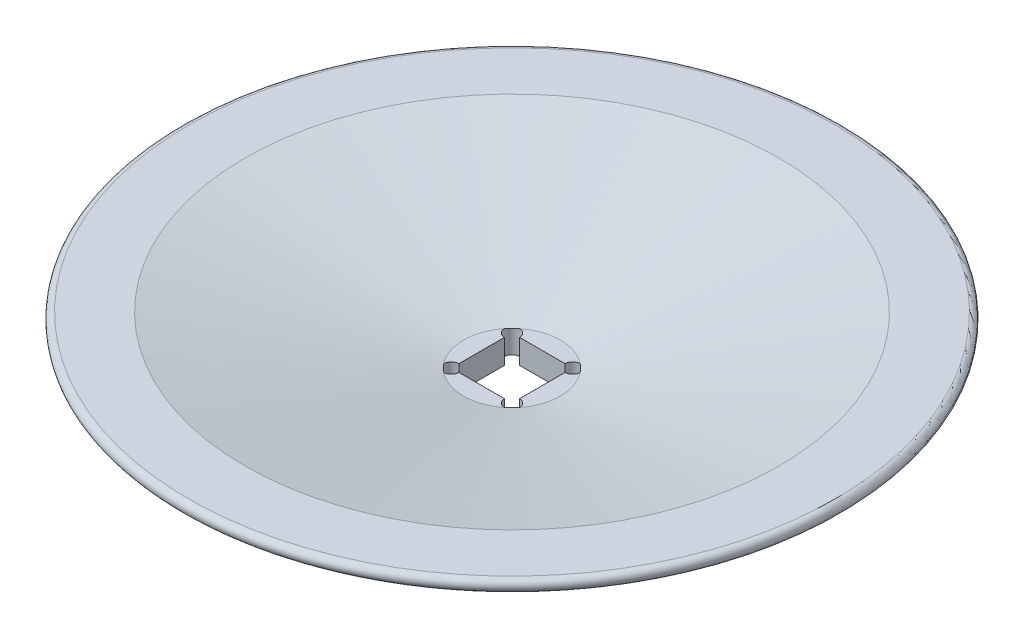
ISO-10303-21;
HEADER;
FILE_DESCRIPTION(('STEP AP214'),'2;1');
FILE_NAME('part.step','',(''),(''),'','','');
FILE_SCHEMA(('AUTOMOTIVE_DESIGN { 1 0 10303 214 1 1 1 1 }'));
ENDSEC;
DATA;
#1=APPLICATION_CONTEXT('core data for automotive mechanical design processes');
#2=APPLICATION_PROTOCOL_DEFINITION('international standard','automotive_design',2000,#1);
#3=PRODUCT_CONTEXT('',#1,'mechanical');
#4=PRODUCT('Part','Part','',(#3));
#5=PRODUCT_RELATED_PRODUCT_CATEGORY('part','',(#4));
#6=PRODUCT_DEFINITION_FORMATION('','',#4);
#7=PRODUCT_DEFINITION_CONTEXT('part definition',#1,'design');
#8=PRODUCT_DEFINITION('design','',#6,#7);
#9=PRODUCT_DEFINITION_SHAPE('','',#8);
#10=(LENGTH_UNIT() NAMED_UNIT(*) SI_UNIT(.MILLI.,.METRE.));
#11=(NAMED_UNIT(*) PLANE_ANGLE_UNIT() SI_UNIT($,.RADIAN.));
#12=(NAMED_UNIT(*) SI_UNIT($,.STERADIAN.) SOLID_ANGLE_UNIT());
#13=UNCERTAINTY_MEASURE_WITH_UNIT(LENGTH_MEASURE(1.E-05),#10,'distance_accuracy_value','');
#14=(GEOMETRIC_REPRESENTATION_CONTEXT(3) GLOBAL_UNCERTAINTY_ASSIGNED_CONTEXT((#13)) GLOBAL_UNIT_ASSIGNED_CONTEXT((#10,
#11,#12)) REPRESENTATION_CONTEXT('',''));
#15=CARTESIAN_POINT('',(0.,0.,0.));
#16=DIRECTION('',(0.,0.,1.));
#17=DIRECTION('',(1.,0.,0.));
#18=AXIS2_PLACEMENT_3D('',#15,#16,#17);
#19=CARTESIAN_POINT('',(0.,0.,0.));
#20=DIRECTION('',(0.,-1.,0.));
#21=DIRECTION('',(0.,0.,-1.));
#22=AXIS2_PLACEMENT_3D('',#19,#20,#21);
#23=PLANE('',#22);
#24=DIRECTION('',(0.,0.,1.));
#25=VECTOR('',#24,1.);
#26=CARTESIAN_POINT('',(2.5,0.,2.5));
#27=LINE('',#26,#25);
#28=CARTESIAN_POINT('',(2.5,0.,-1.875));
#29=VERTEX_POINT('',#28);
#30=CARTESIAN_POINT('',(2.5,0.,1.875));
#31=VERTEX_POINT('',#30);
#32=EDGE_CURVE('E486',#29,#31,#27,.T.);
#33=ORIENTED_EDGE('',*,*,#32,.T.);
#34=CARTESIAN_POINT('',(2.5,0.,2.5));
#35=DIRECTION('',(0.,1.,0.));
#36=DIRECTION('',(0.,0.,1.));
#37=AXIS2_PLACEMENT_3D('',#34,#35,#36);
#38=CIRCLE('',#37,0.625);
#39=CARTESIAN_POINT('',(3.12499222627195,0.,2.49688277372805));
#40=VERTEX_POINT('',#39);
#41=EDGE_CURVE('E575',#40,#31,#38,.T.);
#42=ORIENTED_EDGE('',*,*,#41,.F.);
#43=CARTESIAN_POINT('',(0.,0.,0.));
#44=DIRECTION('',(0.,1.,0.));
#45=DIRECTION('',(0.,0.,1.));
#46=AXIS2_PLACEMENT_3D('',#43,#44,#45);
#47=CIRCLE('',#46,4.);
#48=CARTESIAN_POINT('',(3.12499222627195,0.,-2.49688277372805));
#49=VERTEX_POINT('',#48);
#50=EDGE_CURVE('E441',#40,#49,#47,.T.);
#51=ORIENTED_EDGE('',*,*,#50,.T.);
#52=CARTESIAN_POINT('',(2.5,0.,-2.5));
#53=DIRECTION('',(0.,1.,0.));
#54=DIRECTION('',(0.,0.,1.));
#55=AXIS2_PLACEMENT_3D('',#52,#53,#54);
#56=CIRCLE('',#55,0.625);
#57=EDGE_CURVE('E560',#29,#49,#56,.T.);
#58=ORIENTED_EDGE('',*,*,#57,.F.);
#59=EDGE_LOOP('',(#33,#42,#51,#58));
#60=FACE_BOUND('',#59,.T.);
#61=ADVANCED_FACE('F300',(#60),#23,.F.);
#62=CARTESIAN_POINT('',(-2.49688277372806,0.,3.12499222627195));
#63=VERTEX_POINT('',#62);
#64=CARTESIAN_POINT('',(2.49688277372806,0.,3.12499222627195));
#65=VERTEX_POINT('',#64);
#66=EDGE_CURVE('E418',#63,#65,#47,.T.);
#67=ORIENTED_EDGE('',*,*,#66,.T.);
#68=CARTESIAN_POINT('',(1.875,0.,2.5));
#69=VERTEX_POINT('',#68);
#70=EDGE_CURVE('E578',#69,#65,#38,.T.);
#71=ORIENTED_EDGE('',*,*,#70,.F.);
#72=DIRECTION('',(-1.,0.,0.));
#73=VECTOR('',#72,1.);
#74=CARTESIAN_POINT('',(-2.5,0.,2.5));
#75=LINE('',#74,#73);
#76=CARTESIAN_POINT('',(-1.875,0.,2.5));
#77=VERTEX_POINT('',#76);
#78=EDGE_CURVE('E421',#69,#77,#75,.T.);
#79=ORIENTED_EDGE('',*,*,#78,.T.);
#80=CARTESIAN_POINT('',(-2.5,0.,2.5));
#81=DIRECTION('',(0.,1.,0.));
#82=DIRECTION('',(0.,0.,1.));
#83=AXIS2_PLACEMENT_3D('',#80,#81,#82);
#84=CIRCLE('',#83,0.625);
#85=EDGE_CURVE('E406',#63,#77,#84,.T.);
#86=ORIENTED_EDGE('',*,*,#85,.F.);
#87=EDGE_LOOP('',(#67,#71,#79,#86));
#88=FACE_BOUND('',#87,.T.);
#89=ADVANCED_FACE('F416',(#88),#23,.F.);
#90=CARTESIAN_POINT('',(2.49688277372806,0.,-3.12499222627195));
#91=VERTEX_POINT('',#90);
#92=CARTESIAN_POINT('',(-2.49688277372806,0.,-3.12499222627195));
#93=VERTEX_POINT('',#92);
#94=EDGE_CURVE('E434',#91,#93,#47,.T.);
#95=ORIENTED_EDGE('',*,*,#94,.T.);
#96=CARTESIAN_POINT('',(-2.5,0.,-2.5));
#97=DIRECTION('',(0.,1.,0.));
#98=DIRECTION('',(0.,0.,1.));
#99=AXIS2_PLACEMENT_3D('',#96,#97,#98);
#100=CIRCLE('',#99,0.625);
#101=CARTESIAN_POINT('',(-1.875,0.,-2.5));
#102=VERTEX_POINT('',#101);
#103=EDGE_CURVE('E460',#102,#93,#100,.T.);
#104=ORIENTED_EDGE('',*,*,#103,.F.);
#105=DIRECTION('',(1.,0.,0.));
#106=VECTOR('',#105,1.);
#107=CARTESIAN_POINT('',(-2.5,0.,-2.5));
#108=LINE('',#107,#106);
#109=CARTESIAN_POINT('',(1.875,0.,-2.5));
#110=VERTEX_POINT('',#109);
#111=EDGE_CURVE('E497',#102,#110,#108,.T.);
#112=ORIENTED_EDGE('',*,*,#111,.T.);
#113=EDGE_CURVE('E316',#91,#110,#56,.T.);
#114=ORIENTED_EDGE('',*,*,#113,.F.);
#115=EDGE_LOOP('',(#95,#104,#112,#114));
#116=FACE_BOUND('',#115,.T.);
#117=ADVANCED_FACE('F457',(#116),#23,.F.);
#118=CARTESIAN_POINT('',(-3.12499222627195,0.,-2.49688277372806));
#119=VERTEX_POINT('',#118);
#120=CARTESIAN_POINT('',(-3.12499222627195,0.,2.49688277372806));
#121=VERTEX_POINT('',#120);
#122=EDGE_CURVE('E429',#119,#121,#47,.T.);
#123=ORIENTED_EDGE('',*,*,#122,.T.);
#124=CARTESIAN_POINT('',(-2.5,0.,1.875));
#125=VERTEX_POINT('',#124);
#126=EDGE_CURVE('E409',#125,#121,#84,.T.);
#127=ORIENTED_EDGE('',*,*,#126,.F.);
#128=DIRECTION('',(0.,0.,-1.));
#129=VECTOR('',#128,1.);
#130=CARTESIAN_POINT('',(-2.5,0.,2.5));
#131=LINE('',#130,#129);
#132=CARTESIAN_POINT('',(-2.5,0.,-1.875));
#133=VERTEX_POINT('',#132);
#134=EDGE_CURVE('E493',#125,#133,#131,.T.);
#135=ORIENTED_EDGE('',*,*,#134,.T.);
#136=EDGE_CURVE('E323',#119,#133,#100,.T.);
#137=ORIENTED_EDGE('',*,*,#136,.F.);
#138=EDGE_LOOP('',(#123,#127,#135,#137));
#139=FACE_BOUND('',#138,.T.);
#140=ADVANCED_FACE('F537',(#139),#23,.F.);
#141=CARTESIAN_POINT('',(0.,4.,0.));
#142=DIRECTION('',(0.,1.,0.));
#143=DIRECTION('',(0.,0.,1.));
#144=AXIS2_PLACEMENT_3D('',#141,#142,#143);
#145=CONICAL_SURFACE('',#144,22.,1.35212738092095);
#146=EDGE_CURVE('E427',#65,#40,#47,.T.);
#147=ORIENTED_EDGE('',*,*,#146,.F.);
#148=ORIENTED_EDGE('',*,*,#66,.F.);
#149=CARTESIAN_POINT('',(0.,0.,0.));
#150=DIRECTION('',(0.,1.,0.));
#151=DIRECTION('',(0.,0.,1.));
#152=AXIS2_PLACEMENT_3D('',#149,#150,#151);
#153=CIRCLE('',#152,4.);
#154=EDGE_CURVE('E390',#63,#121,#153,.F.);
#155=ORIENTED_EDGE('',*,*,#154,.T.);
#156=ORIENTED_EDGE('',*,*,#122,.F.);
#157=CARTESIAN_POINT('',(0.,0.,0.));
#158=DIRECTION('',(0.,1.,0.));
#159=DIRECTION('',(0.,0.,1.));
#160=AXIS2_PLACEMENT_3D('',#157,#158,#159);
#161=CIRCLE('',#160,4.);
#162=EDGE_CURVE('E465',#119,#93,#161,.F.);
#163=ORIENTED_EDGE('',*,*,#162,.T.);
#164=ORIENTED_EDGE('',*,*,#94,.F.);
#165=CARTESIAN_POINT('',(0.,0.,0.));
#166=DIRECTION('',(0.,1.,0.));
#167=DIRECTION('',(0.,0.,1.));
#168=AXIS2_PLACEMENT_3D('',#165,#166,#167);
#169=CIRCLE('',#168,4.);
#170=EDGE_CURVE('E464',#91,#49,#169,.F.);
#171=ORIENTED_EDGE('',*,*,#170,.T.);
#172=ORIENTED_EDGE('',*,*,#50,.F.);
#173=EDGE_LOOP('',(#147,#148,#155,#156,#163,#164,#171,#172));
#174=FACE_BOUND('',#173,.T.);
#175=CARTESIAN_POINT('',(0.,4.,0.));
#176=DIRECTION('',(0.,1.,0.));
#177=DIRECTION('',(0.,0.,1.));
#178=AXIS2_PLACEMENT_3D('',#175,#176,#177);
#179=CIRCLE('',#178,22.);
#180=CARTESIAN_POINT('',(0.,4.,22.));
#181=VERTEX_POINT('',#180);
#182=EDGE_CURVE('E430',#181,#181,#179,.T.);
#183=ORIENTED_EDGE('',*,*,#182,.T.);
#184=EDGE_LOOP('',(#183));
#185=FACE_BOUND('',#184,.T.);
#186=ADVANCED_FACE('F424',(#174,#185),#145,.F.);
#187=CARTESIAN_POINT('',(31.2195444572929,4.,0.));
#188=DIRECTION('',(0.,-1.,0.));
#189=DIRECTION('',(0.,0.,-1.));
#190=AXIS2_PLACEMENT_3D('',#187,#188,#189);
#191=PLANE('',#190);
#192=CARTESIAN_POINT('',(0.,4.,0.));
#193=DIRECTION('',(0.,-1.,0.));
#194=DIRECTION('',(0.,0.,-1.));
#195=AXIS2_PLACEMENT_3D('',#192,#193,#194);
#196=CIRCLE('',#195,26.6646583429697);
#197=CARTESIAN_POINT('',(0.,4.,-26.6646583429697));
#198=VERTEX_POINT('',#197);
#199=EDGE_CURVE('E440',#198,#198,#196,.F.);
#200=ORIENTED_EDGE('',*,*,#199,.T.);
#201=EDGE_LOOP('',(#200));
#202=FACE_BOUND('',#201,.T.);
#203=ORIENTED_EDGE('',*,*,#182,.F.);
#204=EDGE_LOOP('',(#203));
#205=FACE_BOUND('',#204,.T.);
#206=ADVANCED_FACE('F547',(#202,#205),#191,.F.);
#207=CARTESIAN_POINT('',(0.,-2.,0.));
#208=DIRECTION('',(0.,1.,0.));
#209=DIRECTION('',(0.,0.,1.));
#210=AXIS2_PLACEMENT_3D('',#207,#208,#209);
#211=CONICAL_SURFACE('',#210,4.21954445729289,1.35212738092095);
#212=CARTESIAN_POINT('',(0.,3.01190646990802,0.));
#213=DIRECTION('',(0.,-1.,0.));
#214=DIRECTION('',(0.,0.,-1.));
#215=AXIS2_PLACEMENT_3D('',#212,#213,#214);
#216=CIRCLE('',#215,26.773123571879);
#217=CARTESIAN_POINT('',(0.,3.01190646990802,26.773123571879));
#218=VERTEX_POINT('',#217);
#219=EDGE_CURVE('E447',#218,#218,#216,.T.);
#220=CARTESIAN_POINT('',(0.,-2.,0.));
#221=DIRECTION('',(0.,1.,0.));
#222=DIRECTION('',(0.,0.,1.));
#223=AXIS2_PLACEMENT_3D('',#220,#221,#222);
#224=CIRCLE('',#223,4.21954445729289);
#225=CARTESIAN_POINT('',(0.,-2.,4.21954445729289));
#226=VERTEX_POINT('',#225);
#227=EDGE_CURVE('E436',#226,#226,#224,.T.);
#228=CARTESIAN_POINT('',(0.,3.01190646990802,26.773123571879));
#229=CARTESIAN_POINT('',(0.,2.95969911084648,26.5381904561021));
#230=CARTESIAN_POINT('',(0.,2.90749175178494,26.3032573403251));
#231=CARTESIAN_POINT('',(0.,2.80307703366186,25.8333911087712));
#232=CARTESIAN_POINT('',(0.,2.75086967460031,25.5984579929943));
#233=CARTESIAN_POINT('',(0.,2.64645495647723,25.1285917614404));
#234=CARTESIAN_POINT('',(0.,2.59424759741569,24.8936586456635));
#235=CARTESIAN_POINT('',(0.,2.4898328792926,24.4237924141096));
#236=CARTESIAN_POINT('',(0.,2.43762552023106,24.1888592983327));
#237=CARTESIAN_POINT('',(0.,2.33321080210798,23.7189930667788));
#238=CARTESIAN_POINT('',(0.,2.28100344304644,23.4840599510019));
#239=CARTESIAN_POINT('',(0.,2.17658872492335,23.014193719448));
#240=CARTESIAN_POINT('',(0.,2.12438136586181,22.779260603671));
#241=CARTESIAN_POINT('',(0.,2.01996664773873,22.3093943721172));
#242=CARTESIAN_POINT('',(0.,1.96775928867719,22.0744612563402));
#243=CARTESIAN_POINT('',(0.,1.8633445705541,21.6045950247863));
#244=CARTESIAN_POINT('',(0.,1.81113721149256,21.3696619090094));
#245=CARTESIAN_POINT('',(0.,1.70672249336948,20.8997956774555));
#246=CARTESIAN_POINT('',(0.,1.65451513430793,20.6648625616786));
#247=CARTESIAN_POINT('',(0.,1.55010041618485,20.1949963301247));
#248=CARTESIAN_POINT('',(0.,1.49789305712331,19.9600632143478));
#249=CARTESIAN_POINT('',(0.,1.39347833900022,19.4901969827939));
#250=CARTESIAN_POINT('',(0.,1.34127097993868,19.255263867017));
#251=CARTESIAN_POINT('',(0.,1.2368562618156,18.7853976354631));
#252=CARTESIAN_POINT('',(0.,1.18464890275406,18.5504645196861));
#253=CARTESIAN_POINT('',(0.,1.08023418463097,18.0805982881323));
#254=CARTESIAN_POINT('',(0.,1.02802682556943,17.8456651723553));
#255=CARTESIAN_POINT('',(0.,0.923612107446347,17.3757989408014));
#256=CARTESIAN_POINT('',(0.,0.871404748384806,17.1408658250245));
#257=CARTESIAN_POINT('',(0.,0.766990030261722,16.6709995934706));
#258=CARTESIAN_POINT('',(0.,0.71478267120018,16.4360664776937));
#259=CARTESIAN_POINT('',(0.,0.610367953077096,15.9662002461398));
#260=CARTESIAN_POINT('',(0.,0.558160594015554,15.7312671303629));
#261=CARTESIAN_POINT('',(0.,0.45374587589247,15.261400898809));
#262=CARTESIAN_POINT('',(0.,0.401538516830928,15.0264677830321));
#263=CARTESIAN_POINT('',(0.,0.297123798707844,14.5566015514782));
#264=CARTESIAN_POINT('',(0.,0.244916439646302,14.3216684357012));
#265=CARTESIAN_POINT('',(0.,0.140501721523218,13.8518022041474));
#266=CARTESIAN_POINT('',(0.,0.0882943624616765,13.6168690883704));
#267=CARTESIAN_POINT('',(0.,-0.0161203556614074,13.1470028568166));
#268=CARTESIAN_POINT('',(0.,-0.0683277147229494,12.9120697410396));
#269=CARTESIAN_POINT('',(0.,-0.172742432846033,12.4422035094857));
#270=CARTESIAN_POINT('',(0.,-0.224949791907575,12.2072703937088));
#271=CARTESIAN_POINT('',(0.,-0.329364510030659,11.7374041621549));
#272=CARTESIAN_POINT('',(0.,-0.381571869092201,11.502471046378));
#273=CARTESIAN_POINT('',(0.,-0.485986587215284,11.0326048148241));
#274=CARTESIAN_POINT('',(0.,-0.538193946276826,10.7976716990472));
#275=CARTESIAN_POINT('',(0.,-0.64260866439991,10.3278054674933));
#276=CARTESIAN_POINT('',(0.,-0.694816023461452,10.0928723517164));
#277=CARTESIAN_POINT('',(0.,-0.799230741584536,9.62300612016248));
#278=CARTESIAN_POINT('',(0.,-0.851438100646078,9.38807300438554));
#279=CARTESIAN_POINT('',(0.,-0.955852818769162,8.91820677283166));
#280=CARTESIAN_POINT('',(0.,-1.0080601778307,8.68327365705472));
#281=CARTESIAN_POINT('',(0.,-1.11247489595379,8.21340742550085));
#282=CARTESIAN_POINT('',(0.,-1.16468225501533,7.97847430972391));
#283=CARTESIAN_POINT('',(0.,-1.26909697313841,7.50860807817003));
#284=CARTESIAN_POINT('',(0.,-1.32130433219995,7.27367496239309));
#285=CARTESIAN_POINT('',(0.,-1.42571905032304,6.80380873083921));
#286=CARTESIAN_POINT('',(0.,-1.47792640938458,6.56887561506227));
#287=CARTESIAN_POINT('',(0.,-1.58234112750766,6.0990093835084));
#288=CARTESIAN_POINT('',(0.,-1.63454848656921,5.86407626773146));
#289=CARTESIAN_POINT('',(0.,-1.73896320469229,5.39421003617758));
#290=CARTESIAN_POINT('',(0.,-1.79117056375383,5.15927692040064));
#291=CARTESIAN_POINT('',(0.,-1.89558528187692,4.68941068884676));
#292=CARTESIAN_POINT('',(0.,-1.94779264093846,4.45447757306983));
#293=CARTESIAN_POINT('',(0.,-2.,4.21954445729289));
#294=B_SPLINE_CURVE_WITH_KNOTS('',3,(#228,#229,#230,#231,#232,#233,#234,#235,#236,#237,#238,
#239,#240,#241,#242,#243,#244,#245,#246,#247,#248,#249,#250,#251,#252,#253,#254,#255,#256,#257,
#258,#259,#260,#261,#262,#263,#264,#265,#266,#267,#268,#269,#270,#271,#272,#273,#274,#275,#276,
#277,#278,#279,#280,#281,#282,#283,#284,#285,#286,#287,#288,#289,#290,#291,#292,#293),
.UNSPECIFIED.,.F.,.F.,(4,2,2,2,2,2,2,2,2,2,2,2,2,2,2,2,2,2,2,2,2,2,2,2,2,2,2,2,2,2,2,2,4),(0.,
0.721992101798608,1.44398420359722,2.16597630539582,2.88796840719443,3.60996050899304,
4.33195261079165,5.05394471259025,5.77593681438886,6.49792891618747,7.21992101798608,
7.94191311978468,8.66390522158329,9.38589732338189,10.1078894251805,10.8298815269791,
11.5518736287777,12.2738657305763,12.9958578323749,13.7178499341735,14.4398420359721,
15.1618341377708,15.8838262395694,16.605818341368,17.3278104431666,18.0498025449652,
18.7717946467638,19.4937867485624,20.215778850361,20.9377709521596,21.6597630539582,
22.3817551557568,23.1037472575554),.UNSPECIFIED.);
#295=EDGE_CURVE('BSEAM518',#218,#226,#294,.T.);
#296=ORIENTED_EDGE('',*,*,#219,.T.);
#297=ORIENTED_EDGE('',*,*,#227,.T.);
#298=ORIENTED_EDGE('',*,*,#295,.T.);
#299=ORIENTED_EDGE('',*,*,#295,.F.);
#300=EDGE_LOOP('',(#296,#298,#297,#299));
#301=FACE_BOUND('',#300,.T.);
#302=ADVANCED_FACE('F518',(#301),#211,.T.);
#303=CARTESIAN_POINT('',(0.,3.5,0.));
#304=DIRECTION('',(0.,-1.,0.));
#305=DIRECTION('',(0.,0.,-1.));
#306=AXIS2_PLACEMENT_3D('',#303,#304,#305);
#307=TOROIDAL_SURFACE('',#306,26.6646583429697,0.5);
#308=ORIENTED_EDGE('',*,*,#219,.F.);
#309=EDGE_LOOP('',(#308));
#310=FACE_BOUND('',#309,.T.);
#311=ORIENTED_EDGE('',*,*,#199,.F.);
#312=EDGE_LOOP('',(#311));
#313=FACE_BOUND('',#312,.T.);
#314=ADVANCED_FACE('F302',(#310,#313),#307,.T.);
#315=CARTESIAN_POINT('',(0.,-2.,0.));
#316=DIRECTION('',(0.,1.,0.));
#317=DIRECTION('',(0.,0.,1.));
#318=AXIS2_PLACEMENT_3D('',#315,#316,#317);
#319=PLANE('',#318);
#320=DIRECTION('',(-1.,0.,0.));
#321=VECTOR('',#320,1.);
#322=CARTESIAN_POINT('',(-2.5,-2.,2.5));
#323=LINE('',#322,#321);
#324=CARTESIAN_POINT('',(1.875,-2.,2.5));
#325=VERTEX_POINT('',#324);
#326=CARTESIAN_POINT('',(-1.875,-2.,2.5));
#327=VERTEX_POINT('',#326);
#328=EDGE_CURVE('E503',#325,#327,#323,.T.);
#329=ORIENTED_EDGE('',*,*,#328,.F.);
#330=CARTESIAN_POINT('',(2.5,-2.,2.5));
#331=DIRECTION('',(0.,1.,0.));
#332=DIRECTION('',(0.,0.,1.));
#333=AXIS2_PLACEMENT_3D('',#330,#331,#332);
#334=CIRCLE('',#333,0.625);
#335=CARTESIAN_POINT('',(2.5,-2.,1.875));
#336=VERTEX_POINT('',#335);
#337=EDGE_CURVE('E570',#325,#336,#334,.T.);
#338=ORIENTED_EDGE('',*,*,#337,.T.);
#339=DIRECTION('',(0.,0.,1.));
#340=VECTOR('',#339,1.);
#341=CARTESIAN_POINT('',(2.5,-2.,2.5));
#342=LINE('',#341,#340);
#343=CARTESIAN_POINT('',(2.5,-2.,-1.875));
#344=VERTEX_POINT('',#343);
#345=EDGE_CURVE('E485',#344,#336,#342,.T.);
#346=ORIENTED_EDGE('',*,*,#345,.F.);
#347=CARTESIAN_POINT('',(2.5,-2.,-2.5));
#348=DIRECTION('',(0.,1.,0.));
#349=DIRECTION('',(0.,0.,1.));
#350=AXIS2_PLACEMENT_3D('',#347,#348,#349);
#351=CIRCLE('',#350,0.625);
#352=CARTESIAN_POINT('',(1.875,-2.,-2.5));
#353=VERTEX_POINT('',#352);
#354=EDGE_CURVE('E401',#344,#353,#351,.T.);
#355=ORIENTED_EDGE('',*,*,#354,.T.);
#356=DIRECTION('',(1.,0.,0.));
#357=VECTOR('',#356,1.);
#358=CARTESIAN_POINT('',(-2.5,-2.,-2.5));
#359=LINE('',#358,#357);
#360=CARTESIAN_POINT('',(-1.875,-2.,-2.5));
#361=VERTEX_POINT('',#360);
#362=EDGE_CURVE('E490',#361,#353,#359,.T.);
#363=ORIENTED_EDGE('',*,*,#362,.F.);
#364=CARTESIAN_POINT('',(-2.5,-2.,-2.5));
#365=DIRECTION('',(0.,1.,0.));
#366=DIRECTION('',(0.,0.,1.));
#367=AXIS2_PLACEMENT_3D('',#364,#365,#366);
#368=CIRCLE('',#367,0.625);
#369=CARTESIAN_POINT('',(-2.5,-2.,-1.875));
#370=VERTEX_POINT('',#369);
#371=EDGE_CURVE('E423',#361,#370,#368,.T.);
#372=ORIENTED_EDGE('',*,*,#371,.T.);
#373=DIRECTION('',(0.,0.,-1.));
#374=VECTOR('',#373,1.);
#375=CARTESIAN_POINT('',(-2.5,-2.,2.5));
#376=LINE('',#375,#374);
#377=CARTESIAN_POINT('',(-2.5,-2.,1.875));
#378=VERTEX_POINT('',#377);
#379=EDGE_CURVE('E507',#378,#370,#376,.T.);
#380=ORIENTED_EDGE('',*,*,#379,.F.);
#381=CARTESIAN_POINT('',(-2.5,-2.,2.5));
#382=DIRECTION('',(0.,1.,0.));
#383=DIRECTION('',(0.,0.,1.));
#384=AXIS2_PLACEMENT_3D('',#381,#382,#383);
#385=CIRCLE('',#384,0.625);
#386=EDGE_CURVE('E411',#378,#327,#385,.T.);
#387=ORIENTED_EDGE('',*,*,#386,.T.);
#388=EDGE_LOOP('',(#329,#338,#346,#355,#363,#372,#380,#387));
#389=FACE_BOUND('',#388,.T.);
#390=ORIENTED_EDGE('',*,*,#227,.F.);
#391=EDGE_LOOP('',(#390));
#392=FACE_BOUND('',#391,.T.);
#393=ADVANCED_FACE('F520',(#389,#392),#319,.F.);
#394=CARTESIAN_POINT('',(2.5,0.,2.5));
#395=DIRECTION('',(1.,0.,0.));
#396=DIRECTION('',(0.,0.,-1.));
#397=AXIS2_PLACEMENT_3D('',#394,#395,#396);
#398=PLANE('',#397);
#399=ORIENTED_EDGE('',*,*,#345,.T.);
#400=DIRECTION('',(0.,1.,0.));
#401=VECTOR('',#400,1.);
#402=CARTESIAN_POINT('',(2.5,-2.,1.875));
#403=LINE('',#402,#401);
#404=EDGE_CURVE('E469',#336,#31,#403,.T.);
#405=ORIENTED_EDGE('',*,*,#404,.T.);
#406=ORIENTED_EDGE('',*,*,#32,.F.);
#407=DIRECTION('',(0.,1.,0.));
#408=VECTOR('',#407,1.);
#409=CARTESIAN_POINT('',(2.5,-2.,-1.875));
#410=LINE('',#409,#408);
#411=EDGE_CURVE('E481',#29,#344,#410,.F.);
#412=ORIENTED_EDGE('',*,*,#411,.T.);
#413=EDGE_LOOP('',(#399,#405,#406,#412));
#414=FACE_BOUND('',#413,.T.);
#415=ADVANCED_FACE('F522',(#414),#398,.F.);
#416=CARTESIAN_POINT('',(-2.5,0.,-2.5));
#417=DIRECTION('',(0.,0.,-1.));
#418=DIRECTION('',(-1.,0.,0.));
#419=AXIS2_PLACEMENT_3D('',#416,#417,#418);
#420=PLANE('',#419);
#421=ORIENTED_EDGE('',*,*,#111,.F.);
#422=DIRECTION('',(0.,1.,0.));
#423=VECTOR('',#422,1.);
#424=CARTESIAN_POINT('',(-1.875,-2.,-2.5));
#425=LINE('',#424,#423);
#426=EDGE_CURVE('E468',#102,#361,#425,.F.);
#427=ORIENTED_EDGE('',*,*,#426,.T.);
#428=ORIENTED_EDGE('',*,*,#362,.T.);
#429=DIRECTION('',(0.,1.,0.));
#430=VECTOR('',#429,1.);
#431=CARTESIAN_POINT('',(1.875,-2.,-2.5));
#432=LINE('',#431,#430);
#433=EDGE_CURVE('E13',#353,#110,#432,.T.);
#434=ORIENTED_EDGE('',*,*,#433,.T.);
#435=EDGE_LOOP('',(#421,#427,#428,#434));
#436=FACE_BOUND('',#435,.T.);
#437=ADVANCED_FACE('F529',(#436),#420,.F.);
#438=CARTESIAN_POINT('',(-2.5,0.,2.5));
#439=DIRECTION('',(-1.,0.,0.));
#440=DIRECTION('',(0.,0.,1.));
#441=AXIS2_PLACEMENT_3D('',#438,#439,#440);
#442=PLANE('',#441);
#443=ORIENTED_EDGE('',*,*,#134,.F.);
#444=DIRECTION('',(0.,1.,0.));
#445=VECTOR('',#444,1.);
#446=CARTESIAN_POINT('',(-2.5,-2.,1.875));
#447=LINE('',#446,#445);
#448=EDGE_CURVE('E400',#125,#378,#447,.F.);
#449=ORIENTED_EDGE('',*,*,#448,.T.);
#450=ORIENTED_EDGE('',*,*,#379,.T.);
#451=DIRECTION('',(0.,1.,0.));
#452=VECTOR('',#451,1.);
#453=CARTESIAN_POINT('',(-2.5,-2.,-1.875));
#454=LINE('',#453,#452);
#455=EDGE_CURVE('E309',#370,#133,#454,.T.);
#456=ORIENTED_EDGE('',*,*,#455,.T.);
#457=EDGE_LOOP('',(#443,#449,#450,#456));
#458=FACE_BOUND('',#457,.T.);
#459=ADVANCED_FACE('F637',(#458),#442,.F.);
#460=CARTESIAN_POINT('',(-2.5,0.,2.5));
#461=DIRECTION('',(0.,0.,1.));
#462=DIRECTION('',(1.,0.,0.));
#463=AXIS2_PLACEMENT_3D('',#460,#461,#462);
#464=PLANE('',#463);
#465=ORIENTED_EDGE('',*,*,#78,.F.);
#466=DIRECTION('',(0.,1.,0.));
#467=VECTOR('',#466,1.);
#468=CARTESIAN_POINT('',(1.875,-2.,2.5));
#469=LINE('',#468,#467);
#470=EDGE_CURVE('E587',#69,#325,#469,.F.);
#471=ORIENTED_EDGE('',*,*,#470,.T.);
#472=ORIENTED_EDGE('',*,*,#328,.T.);
#473=DIRECTION('',(0.,1.,0.));
#474=VECTOR('',#473,1.);
#475=CARTESIAN_POINT('',(-1.875,-2.,2.5));
#476=LINE('',#475,#474);
#477=EDGE_CURVE('E586',#327,#77,#476,.T.);
#478=ORIENTED_EDGE('',*,*,#477,.T.);
#479=EDGE_LOOP('',(#465,#471,#472,#478));
#480=FACE_BOUND('',#479,.T.);
#481=ADVANCED_FACE('F585',(#480),#464,.F.);
#482=CARTESIAN_POINT('',(-2.5,-2.,2.5));
#483=DIRECTION('',(0.,1.,0.));
#484=DIRECTION('',(0.,0.,1.));
#485=AXIS2_PLACEMENT_3D('',#482,#483,#484);
#486=CYLINDRICAL_SURFACE('',#485,0.625);
#487=ORIENTED_EDGE('',*,*,#126,.T.);
#488=EDGE_CURVE('E393',#121,#63,#84,.T.);
#489=ORIENTED_EDGE('',*,*,#488,.T.);
#490=ORIENTED_EDGE('',*,*,#85,.T.);
#491=ORIENTED_EDGE('',*,*,#477,.F.);
#492=ORIENTED_EDGE('',*,*,#386,.F.);
#493=ORIENTED_EDGE('',*,*,#448,.F.);
#494=EDGE_LOOP('',(#487,#489,#490,#491,#492,#493));
#495=FACE_BOUND('',#494,.T.);
#496=ADVANCED_FACE('F405',(#495),#486,.F.);
#497=CARTESIAN_POINT('',(-2.5,0.,2.5));
#498=DIRECTION('',(0.,1.,0.));
#499=DIRECTION('',(0.,0.,1.));
#500=AXIS2_PLACEMENT_3D('',#497,#498,#499);
#501=PLANE('',#500);
#502=ORIENTED_EDGE('',*,*,#488,.F.);
#503=ORIENTED_EDGE('',*,*,#154,.F.);
#504=EDGE_LOOP('',(#502,#503));
#505=FACE_BOUND('',#504,.T.);
#506=ADVANCED_FACE('F392',(#505),#501,.F.);
#507=CARTESIAN_POINT('',(2.5,-2.,2.5));
#508=DIRECTION('',(0.,1.,0.));
#509=DIRECTION('',(0.,0.,1.));
#510=AXIS2_PLACEMENT_3D('',#507,#508,#509);
#511=CYLINDRICAL_SURFACE('',#510,0.625);
#512=ORIENTED_EDGE('',*,*,#337,.F.);
#513=ORIENTED_EDGE('',*,*,#470,.F.);
#514=ORIENTED_EDGE('',*,*,#70,.T.);
#515=EDGE_CURVE('E574',#65,#40,#38,.T.);
#516=ORIENTED_EDGE('',*,*,#515,.T.);
#517=ORIENTED_EDGE('',*,*,#41,.T.);
#518=ORIENTED_EDGE('',*,*,#404,.F.);
#519=EDGE_LOOP('',(#512,#513,#514,#516,#517,#518));
#520=FACE_BOUND('',#519,.T.);
#521=ADVANCED_FACE('F686',(#520),#511,.F.);
#522=CARTESIAN_POINT('',(2.5,0.,2.5));
#523=DIRECTION('',(0.,1.,0.));
#524=DIRECTION('',(0.,0.,1.));
#525=AXIS2_PLACEMENT_3D('',#522,#523,#524);
#526=PLANE('',#525);
#527=ORIENTED_EDGE('',*,*,#515,.F.);
#528=ORIENTED_EDGE('',*,*,#146,.T.);
#529=EDGE_LOOP('',(#527,#528));
#530=FACE_BOUND('',#529,.T.);
#531=ADVANCED_FACE('F695',(#530),#526,.F.);
#532=CARTESIAN_POINT('',(-2.5,-2.,-2.5));
#533=DIRECTION('',(0.,1.,0.));
#534=DIRECTION('',(0.,0.,1.));
#535=AXIS2_PLACEMENT_3D('',#532,#533,#534);
#536=CYLINDRICAL_SURFACE('',#535,0.625);
#537=ORIENTED_EDGE('',*,*,#103,.T.);
#538=EDGE_CURVE('E550',#93,#119,#100,.T.);
#539=ORIENTED_EDGE('',*,*,#538,.T.);
#540=ORIENTED_EDGE('',*,*,#136,.T.);
#541=ORIENTED_EDGE('',*,*,#455,.F.);
#542=ORIENTED_EDGE('',*,*,#371,.F.);
#543=ORIENTED_EDGE('',*,*,#426,.F.);
#544=EDGE_LOOP('',(#537,#539,#540,#541,#542,#543));
#545=FACE_BOUND('',#544,.T.);
#546=ADVANCED_FACE('F704',(#545),#536,.F.);
#547=CARTESIAN_POINT('',(-2.5,0.,-2.5));
#548=DIRECTION('',(0.,1.,0.));
#549=DIRECTION('',(0.,0.,1.));
#550=AXIS2_PLACEMENT_3D('',#547,#548,#549);
#551=PLANE('',#550);
#552=ORIENTED_EDGE('',*,*,#538,.F.);
#553=ORIENTED_EDGE('',*,*,#162,.F.);
#554=EDGE_LOOP('',(#552,#553));
#555=FACE_BOUND('',#554,.T.);
#556=ADVANCED_FACE('F713',(#555),#551,.F.);
#557=CARTESIAN_POINT('',(2.5,-2.,-2.5));
#558=DIRECTION('',(0.,1.,0.));
#559=DIRECTION('',(0.,0.,1.));
#560=AXIS2_PLACEMENT_3D('',#557,#558,#559);
#561=CYLINDRICAL_SURFACE('',#560,0.625);
#562=ORIENTED_EDGE('',*,*,#57,.T.);
#563=EDGE_CURVE('E558',#49,#91,#56,.T.);
#564=ORIENTED_EDGE('',*,*,#563,.T.);
#565=ORIENTED_EDGE('',*,*,#113,.T.);
#566=ORIENTED_EDGE('',*,*,#433,.F.);
#567=ORIENTED_EDGE('',*,*,#354,.F.);
#568=ORIENTED_EDGE('',*,*,#411,.F.);
#569=EDGE_LOOP('',(#562,#564,#565,#566,#567,#568));
#570=FACE_BOUND('',#569,.T.);
#571=ADVANCED_FACE('F722',(#570),#561,.F.);
#572=CARTESIAN_POINT('',(2.5,0.,-2.5));
#573=DIRECTION('',(0.,1.,0.));
#574=DIRECTION('',(0.,0.,1.));
#575=AXIS2_PLACEMENT_3D('',#572,#573,#574);
#576=PLANE('',#575);
#577=ORIENTED_EDGE('',*,*,#563,.F.);
#578=ORIENTED_EDGE('',*,*,#170,.F.);
#579=EDGE_LOOP('',(#577,#578));
#580=FACE_BOUND('',#579,.T.);
#581=ADVANCED_FACE('F731',(#580),#576,.F.);
#582=CLOSED_SHELL('',(#61,#89,#117,#140,#186,#206,#302,#314,#393,#415,#437,#459,#481,#496,#506,
#521,#531,#546,#556,#571,#581));
#583=MANIFOLD_SOLID_BREP('B2',#582);
#584=ADVANCED_BREP_SHAPE_REPRESENTATION('',(#18,#583),#14);
#585=SHAPE_DEFINITION_REPRESENTATION(#9,#584);
ENDSEC;
END-ISO-10303-21;
